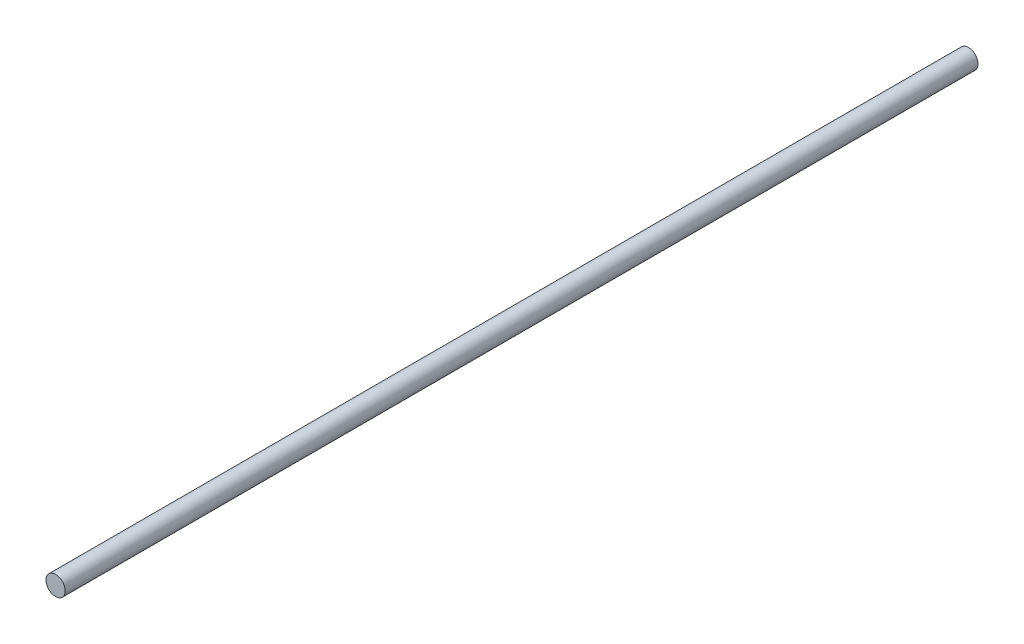
ISO-10303-21;
HEADER;
FILE_DESCRIPTION(('STEP AP214'),'2;1');
FILE_NAME('part.step','',(''),(''),'','','');
FILE_SCHEMA(('AUTOMOTIVE_DESIGN { 1 0 10303 214 1 1 1 1 }'));
ENDSEC;
DATA;
#1=APPLICATION_CONTEXT('core data for automotive mechanical design processes');
#2=APPLICATION_PROTOCOL_DEFINITION('international standard','automotive_design',2000,#1);
#3=PRODUCT_CONTEXT('',#1,'mechanical');
#4=PRODUCT('Part','Part','',(#3));
#5=PRODUCT_RELATED_PRODUCT_CATEGORY('part','',(#4));
#6=PRODUCT_DEFINITION_FORMATION('','',#4);
#7=PRODUCT_DEFINITION_CONTEXT('part definition',#1,'design');
#8=PRODUCT_DEFINITION('design','',#6,#7);
#9=PRODUCT_DEFINITION_SHAPE('','',#8);
#10=(LENGTH_UNIT() NAMED_UNIT(*) SI_UNIT(.MILLI.,.METRE.));
#11=(NAMED_UNIT(*) PLANE_ANGLE_UNIT() SI_UNIT($,.RADIAN.));
#12=(NAMED_UNIT(*) SI_UNIT($,.STERADIAN.) SOLID_ANGLE_UNIT());
#13=UNCERTAINTY_MEASURE_WITH_UNIT(LENGTH_MEASURE(1.E-05),#10,'distance_accuracy_value','');
#14=(GEOMETRIC_REPRESENTATION_CONTEXT(3) GLOBAL_UNCERTAINTY_ASSIGNED_CONTEXT((#13)) GLOBAL_UNIT_ASSIGNED_CONTEXT((#10,
#11,#12)) REPRESENTATION_CONTEXT('',''));
#15=CARTESIAN_POINT('',(0.,0.,0.));
#16=DIRECTION('',(0.,0.,1.));
#17=DIRECTION('',(1.,0.,0.));
#18=AXIS2_PLACEMENT_3D('',#15,#16,#17);
#19=CARTESIAN_POINT('',(0.,0.,285.));
#20=DIRECTION('',(0.,0.,-1.));
#21=DIRECTION('',(-1.,0.,0.));
#22=AXIS2_PLACEMENT_3D('',#19,#20,#21);
#23=CYLINDRICAL_SURFACE('',#22,3.);
#24=CARTESIAN_POINT('',(0.,0.,285.));
#25=DIRECTION('',(0.,0.,1.));
#26=DIRECTION('',(1.,0.,0.));
#27=AXIS2_PLACEMENT_3D('',#24,#25,#26);
#28=CIRCLE('',#27,3.);
#29=CARTESIAN_POINT('',(3.,0.,285.));
#30=VERTEX_POINT('',#29);
#31=EDGE_CURVE('E10',#30,#30,#28,.T.);
#32=ORIENTED_EDGE('',*,*,#31,.F.);
#33=EDGE_LOOP('',(#32));
#34=FACE_BOUND('',#33,.T.);
#35=CARTESIAN_POINT('',(0.,0.,0.));
#36=DIRECTION('',(0.,0.,1.));
#37=DIRECTION('',(1.,0.,0.));
#38=AXIS2_PLACEMENT_3D('',#35,#36,#37);
#39=CIRCLE('',#38,3.);
#40=CARTESIAN_POINT('',(3.,0.,0.));
#41=VERTEX_POINT('',#40);
#42=EDGE_CURVE('E32',#41,#41,#39,.T.);
#43=ORIENTED_EDGE('',*,*,#42,.T.);
#44=EDGE_LOOP('',(#43));
#45=FACE_BOUND('',#44,.T.);
#46=ADVANCED_FACE('F29',(#34,#45),#23,.T.);
#47=CARTESIAN_POINT('',(0.,0.,285.));
#48=DIRECTION('',(0.,0.,1.));
#49=DIRECTION('',(1.,0.,0.));
#50=AXIS2_PLACEMENT_3D('',#47,#48,#49);
#51=PLANE('',#50);
#52=ORIENTED_EDGE('',*,*,#31,.T.);
#53=EDGE_LOOP('',(#52));
#54=FACE_BOUND('',#53,.T.);
#55=ADVANCED_FACE('F44',(#54),#51,.T.);
#56=CARTESIAN_POINT('',(0.,0.,0.));
#57=DIRECTION('',(0.,0.,1.));
#58=DIRECTION('',(1.,0.,0.));
#59=AXIS2_PLACEMENT_3D('',#56,#57,#58);
#60=PLANE('',#59);
#61=ORIENTED_EDGE('',*,*,#42,.F.);
#62=EDGE_LOOP('',(#61));
#63=FACE_BOUND('',#62,.T.);
#64=ADVANCED_FACE('F42',(#63),#60,.F.);
#65=CLOSED_SHELL('',(#46,#55,#64));
#66=MANIFOLD_SOLID_BREP('B2',#65);
#67=ADVANCED_BREP_SHAPE_REPRESENTATION('',(#18,#66),#14);
#68=SHAPE_DEFINITION_REPRESENTATION(#9,#67);
ENDSEC;
END-ISO-10303-21;
